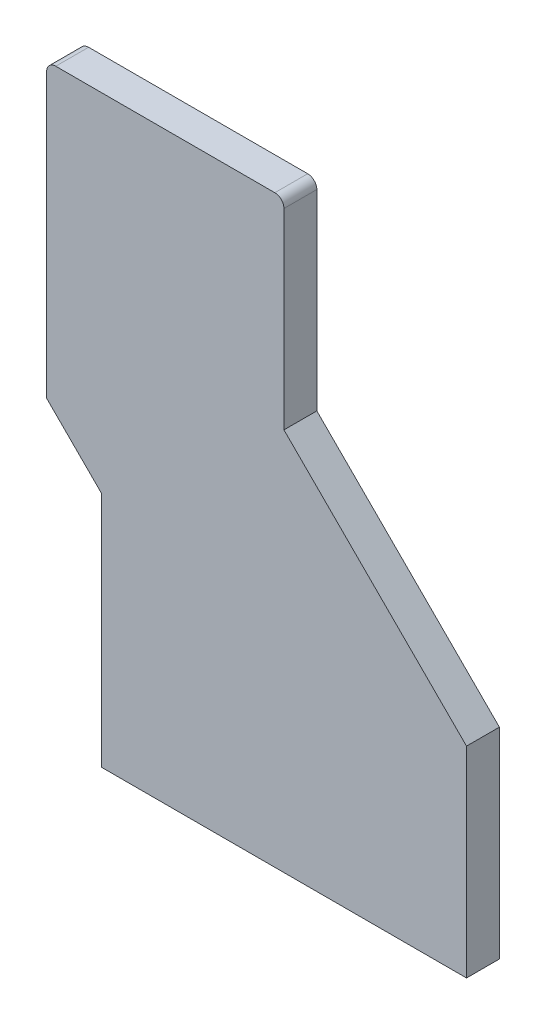
ISO-10303-21;
HEADER;
FILE_DESCRIPTION(('STEP AP214'),'2;1');
FILE_NAME('part.step','',(''),(''),'','','');
FILE_SCHEMA(('AUTOMOTIVE_DESIGN { 1 0 10303 214 1 1 1 1 }'));
ENDSEC;
DATA;
#1=APPLICATION_CONTEXT('core data for automotive mechanical design processes');
#2=APPLICATION_PROTOCOL_DEFINITION('international standard','automotive_design',2000,#1);
#3=PRODUCT_CONTEXT('',#1,'mechanical');
#4=PRODUCT('Part','Part','',(#3));
#5=PRODUCT_RELATED_PRODUCT_CATEGORY('part','',(#4));
#6=PRODUCT_DEFINITION_FORMATION('','',#4);
#7=PRODUCT_DEFINITION_CONTEXT('part definition',#1,'design');
#8=PRODUCT_DEFINITION('design','',#6,#7);
#9=PRODUCT_DEFINITION_SHAPE('','',#8);
#10=(LENGTH_UNIT() NAMED_UNIT(*) SI_UNIT(.MILLI.,.METRE.));
#11=(NAMED_UNIT(*) PLANE_ANGLE_UNIT() SI_UNIT($,.RADIAN.));
#12=(NAMED_UNIT(*) SI_UNIT($,.STERADIAN.) SOLID_ANGLE_UNIT());
#13=UNCERTAINTY_MEASURE_WITH_UNIT(LENGTH_MEASURE(1.E-05),#10,'distance_accuracy_value','');
#14=(GEOMETRIC_REPRESENTATION_CONTEXT(3) GLOBAL_UNCERTAINTY_ASSIGNED_CONTEXT((#13)) GLOBAL_UNIT_ASSIGNED_CONTEXT((#10,
#11,#12)) REPRESENTATION_CONTEXT('',''));
#15=CARTESIAN_POINT('',(0.,0.,0.));
#16=DIRECTION('',(0.,0.,1.));
#17=DIRECTION('',(1.,0.,0.));
#18=AXIS2_PLACEMENT_3D('',#15,#16,#17);
#19=CARTESIAN_POINT('',(104.070181983146,-56.5122911730335,18.));
#20=DIRECTION('',(-1.,0.,0.));
#21=DIRECTION('',(0.,0.,1.));
#22=AXIS2_PLACEMENT_3D('',#19,#20,#21);
#23=PLANE('',#22);
#24=DIRECTION('',(0.,1.,0.));
#25=VECTOR('',#24,1.);
#26=CARTESIAN_POINT('',(104.070181983146,-56.5122911730335,0.));
#27=LINE('',#26,#25);
#28=CARTESIAN_POINT('',(104.070181983146,-166.512291173034,0.));
#29=VERTEX_POINT('',#28);
#30=CARTESIAN_POINT('',(104.070181983146,-56.5122911730335,0.));
#31=VERTEX_POINT('',#30);
#32=EDGE_CURVE('E141',#29,#31,#27,.T.);
#33=ORIENTED_EDGE('',*,*,#32,.T.);
#34=DIRECTION('',(0.,0.,-1.));
#35=VECTOR('',#34,1.);
#36=CARTESIAN_POINT('',(104.070181983146,-56.5122911730335,18.));
#37=LINE('',#36,#35);
#38=CARTESIAN_POINT('',(104.070181983146,-56.5122911730335,18.));
#39=VERTEX_POINT('',#38);
#40=EDGE_CURVE('E11',#39,#31,#37,.T.);
#41=ORIENTED_EDGE('',*,*,#40,.F.);
#42=DIRECTION('',(0.,1.,0.));
#43=VECTOR('',#42,1.);
#44=CARTESIAN_POINT('',(104.070181983146,-56.5122911730335,18.));
#45=LINE('',#44,#43);
#46=CARTESIAN_POINT('',(104.070181983146,-166.512291173034,18.));
#47=VERTEX_POINT('',#46);
#48=EDGE_CURVE('E160',#47,#39,#45,.T.);
#49=ORIENTED_EDGE('',*,*,#48,.F.);
#50=DIRECTION('',(0.,0.,-1.));
#51=VECTOR('',#50,1.);
#52=CARTESIAN_POINT('',(104.070181983146,-166.512291173034,18.));
#53=LINE('',#52,#51);
#54=EDGE_CURVE('E137',#47,#29,#53,.T.);
#55=ORIENTED_EDGE('',*,*,#54,.T.);
#56=EDGE_LOOP('',(#33,#41,#49,#55));
#57=FACE_BOUND('',#56,.T.);
#58=ADVANCED_FACE('F33',(#57),#23,.F.);
#59=CARTESIAN_POINT('',(4.07018198314597,43.4877088269665,18.));
#60=DIRECTION('',(-0.707106781186547,-0.707106781186547,0.));
#61=DIRECTION('',(0.707106781186548,-0.707106781186548,0.));
#62=AXIS2_PLACEMENT_3D('',#59,#60,#61);
#63=PLANE('',#62);
#64=DIRECTION('',(-0.707106781186547,0.707106781186547,0.));
#65=VECTOR('',#64,1.);
#66=CARTESIAN_POINT('',(4.07018198314597,43.4877088269665,0.));
#67=LINE('',#66,#65);
#68=CARTESIAN_POINT('',(4.07018198314597,43.4877088269665,0.));
#69=VERTEX_POINT('',#68);
#70=EDGE_CURVE('E144',#31,#69,#67,.T.);
#71=ORIENTED_EDGE('',*,*,#70,.T.);
#72=DIRECTION('',(0.,0.,-1.));
#73=VECTOR('',#72,1.);
#74=CARTESIAN_POINT('',(4.07018198314597,43.4877088269665,18.));
#75=LINE('',#74,#73);
#76=CARTESIAN_POINT('',(4.07018198314597,43.4877088269665,18.));
#77=VERTEX_POINT('',#76);
#78=EDGE_CURVE('E41',#77,#69,#75,.T.);
#79=ORIENTED_EDGE('',*,*,#78,.F.);
#80=DIRECTION('',(-0.707106781186547,0.707106781186547,0.));
#81=VECTOR('',#80,1.);
#82=CARTESIAN_POINT('',(4.07018198314597,43.4877088269665,18.));
#83=LINE('',#82,#81);
#84=EDGE_CURVE('E98',#39,#77,#83,.T.);
#85=ORIENTED_EDGE('',*,*,#84,.F.);
#86=ORIENTED_EDGE('',*,*,#40,.T.);
#87=EDGE_LOOP('',(#71,#79,#85,#86));
#88=FACE_BOUND('',#87,.T.);
#89=ADVANCED_FACE('F208',(#88),#63,.F.);
#90=CARTESIAN_POINT('',(4.07018198314596,148.487708826966,18.));
#91=DIRECTION('',(-1.,0.,0.));
#92=DIRECTION('',(0.,-1.,0.));
#93=AXIS2_PLACEMENT_3D('',#90,#91,#92);
#94=PLANE('',#93);
#95=DIRECTION('',(0.,1.,0.));
#96=VECTOR('',#95,1.);
#97=CARTESIAN_POINT('',(4.07018198314596,148.487708826966,0.));
#98=LINE('',#97,#96);
#99=CARTESIAN_POINT('',(4.07018198314596,148.487708826966,0.));
#100=VERTEX_POINT('',#99);
#101=EDGE_CURVE('E146',#69,#100,#98,.T.);
#102=ORIENTED_EDGE('',*,*,#101,.T.);
#103=DIRECTION('',(0.,0.,-1.));
#104=VECTOR('',#103,1.);
#105=CARTESIAN_POINT('',(4.07018198314596,148.487708826966,18.));
#106=LINE('',#105,#104);
#107=CARTESIAN_POINT('',(4.07018198314596,148.487708826966,18.));
#108=VERTEX_POINT('',#107);
#109=EDGE_CURVE('E173',#108,#100,#106,.T.);
#110=ORIENTED_EDGE('',*,*,#109,.F.);
#111=DIRECTION('',(0.,1.,0.));
#112=VECTOR('',#111,1.);
#113=CARTESIAN_POINT('',(4.07018198314596,148.487708826966,18.));
#114=LINE('',#113,#112);
#115=EDGE_CURVE('E181',#77,#108,#114,.T.);
#116=ORIENTED_EDGE('',*,*,#115,.F.);
#117=ORIENTED_EDGE('',*,*,#78,.T.);
#118=EDGE_LOOP('',(#102,#110,#116,#117));
#119=FACE_BOUND('',#118,.T.);
#120=ADVANCED_FACE('F179',(#119),#94,.F.);
#121=CARTESIAN_POINT('',(-0.929818016854041,148.487708826966,18.));
#122=DIRECTION('',(0.,0.,-1.));
#123=DIRECTION('',(-1.,0.,0.));
#124=AXIS2_PLACEMENT_3D('',#121,#122,#123);
#125=CYLINDRICAL_SURFACE('',#124,5.);
#126=CARTESIAN_POINT('',(-0.929818016854041,148.487708826966,0.));
#127=DIRECTION('',(0.,0.,1.));
#128=DIRECTION('',(1.,0.,0.));
#129=AXIS2_PLACEMENT_3D('',#126,#127,#128);
#130=CIRCLE('',#129,5.);
#131=CARTESIAN_POINT('',(-0.929818016854076,153.487708826966,0.));
#132=VERTEX_POINT('',#131);
#133=EDGE_CURVE('E148',#100,#132,#130,.T.);
#134=ORIENTED_EDGE('',*,*,#133,.T.);
#135=DIRECTION('',(0.,0.,-1.));
#136=VECTOR('',#135,1.);
#137=CARTESIAN_POINT('',(-0.929818016854076,153.487708826966,18.));
#138=LINE('',#137,#136);
#139=CARTESIAN_POINT('',(-0.929818016854076,153.487708826966,18.));
#140=VERTEX_POINT('',#139);
#141=EDGE_CURVE('E170',#140,#132,#138,.T.);
#142=ORIENTED_EDGE('',*,*,#141,.F.);
#143=CARTESIAN_POINT('',(-0.929818016854041,148.487708826966,18.));
#144=DIRECTION('',(0.,0.,1.));
#145=DIRECTION('',(1.,0.,0.));
#146=AXIS2_PLACEMENT_3D('',#143,#144,#145);
#147=CIRCLE('',#146,5.);
#148=EDGE_CURVE('E198',#108,#140,#147,.T.);
#149=ORIENTED_EDGE('',*,*,#148,.F.);
#150=ORIENTED_EDGE('',*,*,#109,.T.);
#151=EDGE_LOOP('',(#134,#142,#149,#150));
#152=FACE_BOUND('',#151,.T.);
#153=ADVANCED_FACE('F189',(#152),#125,.T.);
#154=CARTESIAN_POINT('',(-95.9298180168541,153.487708826966,18.));
#155=DIRECTION('',(0.,-1.,0.));
#156=DIRECTION('',(0.,0.,-1.));
#157=AXIS2_PLACEMENT_3D('',#154,#155,#156);
#158=PLANE('',#157);
#159=DIRECTION('',(-1.,0.,0.));
#160=VECTOR('',#159,1.);
#161=CARTESIAN_POINT('',(-95.9298180168541,153.487708826966,0.));
#162=LINE('',#161,#160);
#163=CARTESIAN_POINT('',(-120.929818016854,153.487708826966,0.));
#164=VERTEX_POINT('',#163);
#165=EDGE_CURVE('E151',#132,#164,#162,.T.);
#166=ORIENTED_EDGE('',*,*,#165,.T.);
#167=DIRECTION('',(0.,0.,-1.));
#168=VECTOR('',#167,1.);
#169=CARTESIAN_POINT('',(-120.929818016854,153.487708826966,18.));
#170=LINE('',#169,#168);
#171=CARTESIAN_POINT('',(-120.929818016854,153.487708826966,18.));
#172=VERTEX_POINT('',#171);
#173=EDGE_CURVE('E167',#172,#164,#170,.T.);
#174=ORIENTED_EDGE('',*,*,#173,.F.);
#175=DIRECTION('',(-1.,0.,0.));
#176=VECTOR('',#175,1.);
#177=CARTESIAN_POINT('',(-95.9298180168541,153.487708826966,18.));
#178=LINE('',#177,#176);
#179=EDGE_CURVE('E195',#140,#172,#178,.T.);
#180=ORIENTED_EDGE('',*,*,#179,.F.);
#181=ORIENTED_EDGE('',*,*,#141,.T.);
#182=EDGE_LOOP('',(#166,#174,#180,#181));
#183=FACE_BOUND('',#182,.T.);
#184=ADVANCED_FACE('F193',(#183),#158,.F.);
#185=CARTESIAN_POINT('',(-120.929818016854,148.487708826966,18.));
#186=DIRECTION('',(0.,0.,-1.));
#187=DIRECTION('',(-1.,0.,0.));
#188=AXIS2_PLACEMENT_3D('',#185,#186,#187);
#189=CYLINDRICAL_SURFACE('',#188,5.);
#190=CARTESIAN_POINT('',(-120.929818016854,148.487708826966,0.));
#191=DIRECTION('',(0.,0.,1.));
#192=DIRECTION('',(1.,0.,0.));
#193=AXIS2_PLACEMENT_3D('',#190,#191,#192);
#194=CIRCLE('',#193,5.);
#195=CARTESIAN_POINT('',(-125.929818016854,148.487708826966,0.));
#196=VERTEX_POINT('',#195);
#197=EDGE_CURVE('E153',#164,#196,#194,.T.);
#198=ORIENTED_EDGE('',*,*,#197,.T.);
#199=DIRECTION('',(0.,0.,-1.));
#200=VECTOR('',#199,1.);
#201=CARTESIAN_POINT('',(-125.929818016854,148.487708826966,18.));
#202=LINE('',#201,#200);
#203=CARTESIAN_POINT('',(-125.929818016854,148.487708826966,18.));
#204=VERTEX_POINT('',#203);
#205=EDGE_CURVE('E164',#204,#196,#202,.T.);
#206=ORIENTED_EDGE('',*,*,#205,.F.);
#207=CARTESIAN_POINT('',(-120.929818016854,148.487708826966,18.));
#208=DIRECTION('',(0.,0.,1.));
#209=DIRECTION('',(1.,0.,0.));
#210=AXIS2_PLACEMENT_3D('',#207,#208,#209);
#211=CIRCLE('',#210,5.);
#212=EDGE_CURVE('E197',#172,#204,#211,.T.);
#213=ORIENTED_EDGE('',*,*,#212,.F.);
#214=ORIENTED_EDGE('',*,*,#173,.T.);
#215=EDGE_LOOP('',(#198,#206,#213,#214));
#216=FACE_BOUND('',#215,.T.);
#217=ADVANCED_FACE('F220',(#216),#189,.T.);
#218=CARTESIAN_POINT('',(-125.929818016854,148.487708826966,18.));
#219=DIRECTION('',(1.,0.,0.));
#220=DIRECTION('',(0.,0.,-1.));
#221=AXIS2_PLACEMENT_3D('',#218,#219,#220);
#222=PLANE('',#221);
#223=DIRECTION('',(0.,-1.,0.));
#224=VECTOR('',#223,1.);
#225=CARTESIAN_POINT('',(-125.929818016854,148.487708826966,0.));
#226=LINE('',#225,#224);
#227=CARTESIAN_POINT('',(-125.929818016854,-6.51229117303351,0.));
#228=VERTEX_POINT('',#227);
#229=EDGE_CURVE('E155',#196,#228,#226,.T.);
#230=ORIENTED_EDGE('',*,*,#229,.T.);
#231=DIRECTION('',(0.,0.,-1.));
#232=VECTOR('',#231,1.);
#233=CARTESIAN_POINT('',(-125.929818016854,-6.51229117303351,18.));
#234=LINE('',#233,#232);
#235=CARTESIAN_POINT('',(-125.929818016854,-6.51229117303351,18.));
#236=VERTEX_POINT('',#235);
#237=EDGE_CURVE('E132',#236,#228,#234,.T.);
#238=ORIENTED_EDGE('',*,*,#237,.F.);
#239=DIRECTION('',(0.,-1.,0.));
#240=VECTOR('',#239,1.);
#241=CARTESIAN_POINT('',(-125.929818016854,148.487708826966,18.));
#242=LINE('',#241,#240);
#243=EDGE_CURVE('E123',#204,#236,#242,.T.);
#244=ORIENTED_EDGE('',*,*,#243,.F.);
#245=ORIENTED_EDGE('',*,*,#205,.T.);
#246=EDGE_LOOP('',(#230,#238,#244,#245));
#247=FACE_BOUND('',#246,.T.);
#248=ADVANCED_FACE('F223',(#247),#222,.F.);
#249=CARTESIAN_POINT('',(-125.929818016854,-6.51229117303351,18.));
#250=DIRECTION('',(0.707106781186548,0.707106781186547,0.));
#251=DIRECTION('',(-0.707106781186547,0.707106781186548,0.));
#252=AXIS2_PLACEMENT_3D('',#249,#250,#251);
#253=PLANE('',#252);
#254=DIRECTION('',(0.707106781186547,-0.707106781186548,0.));
#255=VECTOR('',#254,1.);
#256=CARTESIAN_POINT('',(-125.929818016854,-6.51229117303351,0.));
#257=LINE('',#256,#255);
#258=CARTESIAN_POINT('',(-95.929818016854,-36.5122911730335,0.));
#259=VERTEX_POINT('',#258);
#260=EDGE_CURVE('E131',#228,#259,#257,.T.);
#261=ORIENTED_EDGE('',*,*,#260,.T.);
#262=DIRECTION('',(0.,0.,-1.));
#263=VECTOR('',#262,1.);
#264=CARTESIAN_POINT('',(-95.929818016854,-36.5122911730335,18.));
#265=LINE('',#264,#263);
#266=CARTESIAN_POINT('',(-95.929818016854,-36.5122911730335,18.));
#267=VERTEX_POINT('',#266);
#268=EDGE_CURVE('E128',#267,#259,#265,.T.);
#269=ORIENTED_EDGE('',*,*,#268,.F.);
#270=DIRECTION('',(0.707106781186547,-0.707106781186548,0.));
#271=VECTOR('',#270,1.);
#272=CARTESIAN_POINT('',(-125.929818016854,-6.51229117303351,18.));
#273=LINE('',#272,#271);
#274=EDGE_CURVE('E117',#236,#267,#273,.T.);
#275=ORIENTED_EDGE('',*,*,#274,.F.);
#276=ORIENTED_EDGE('',*,*,#237,.T.);
#277=EDGE_LOOP('',(#261,#269,#275,#276));
#278=FACE_BOUND('',#277,.T.);
#279=ADVANCED_FACE('F129',(#278),#253,.F.);
#280=CARTESIAN_POINT('',(-95.929818016854,-36.5122911730335,18.));
#281=DIRECTION('',(1.,0.,0.));
#282=DIRECTION('',(0.,0.,-1.));
#283=AXIS2_PLACEMENT_3D('',#280,#281,#282);
#284=PLANE('',#283);
#285=DIRECTION('',(0.,-1.,0.));
#286=VECTOR('',#285,1.);
#287=CARTESIAN_POINT('',(-95.929818016854,-36.5122911730335,0.));
#288=LINE('',#287,#286);
#289=CARTESIAN_POINT('',(-95.929818016854,-166.512291173034,0.));
#290=VERTEX_POINT('',#289);
#291=EDGE_CURVE('E84',#259,#290,#288,.T.);
#292=ORIENTED_EDGE('',*,*,#291,.T.);
#293=DIRECTION('',(0.,0.,-1.));
#294=VECTOR('',#293,1.);
#295=CARTESIAN_POINT('',(-95.929818016854,-166.512291173034,18.));
#296=LINE('',#295,#294);
#297=CARTESIAN_POINT('',(-95.929818016854,-166.512291173034,18.));
#298=VERTEX_POINT('',#297);
#299=EDGE_CURVE('E133',#298,#290,#296,.T.);
#300=ORIENTED_EDGE('',*,*,#299,.F.);
#301=DIRECTION('',(0.,-1.,0.));
#302=VECTOR('',#301,1.);
#303=CARTESIAN_POINT('',(-95.929818016854,-36.5122911730335,18.));
#304=LINE('',#303,#302);
#305=EDGE_CURVE('E121',#267,#298,#304,.T.);
#306=ORIENTED_EDGE('',*,*,#305,.F.);
#307=ORIENTED_EDGE('',*,*,#268,.T.);
#308=EDGE_LOOP('',(#292,#300,#306,#307));
#309=FACE_BOUND('',#308,.T.);
#310=ADVANCED_FACE('F135',(#309),#284,.F.);
#311=CARTESIAN_POINT('',(-95.929818016854,-166.512291173034,18.));
#312=DIRECTION('',(0.,1.,0.));
#313=DIRECTION('',(0.,0.,1.));
#314=AXIS2_PLACEMENT_3D('',#311,#312,#313);
#315=PLANE('',#314);
#316=DIRECTION('',(1.,0.,0.));
#317=VECTOR('',#316,1.);
#318=CARTESIAN_POINT('',(-95.929818016854,-166.512291173034,0.));
#319=LINE('',#318,#317);
#320=EDGE_CURVE('E90',#290,#29,#319,.T.);
#321=ORIENTED_EDGE('',*,*,#320,.T.);
#322=ORIENTED_EDGE('',*,*,#54,.F.);
#323=DIRECTION('',(1.,0.,0.));
#324=VECTOR('',#323,1.);
#325=CARTESIAN_POINT('',(-95.929818016854,-166.512291173034,18.));
#326=LINE('',#325,#324);
#327=EDGE_CURVE('E49',#298,#47,#326,.T.);
#328=ORIENTED_EDGE('',*,*,#327,.F.);
#329=ORIENTED_EDGE('',*,*,#299,.T.);
#330=EDGE_LOOP('',(#321,#322,#328,#329));
#331=FACE_BOUND('',#330,.T.);
#332=ADVANCED_FACE('F232',(#331),#315,.F.);
#333=CARTESIAN_POINT('',(-120.929818016854,148.487708826966,18.));
#334=DIRECTION('',(0.,0.,1.));
#335=DIRECTION('',(1.,0.,0.));
#336=AXIS2_PLACEMENT_3D('',#333,#334,#335);
#337=PLANE('',#336);
#338=ORIENTED_EDGE('',*,*,#48,.T.);
#339=ORIENTED_EDGE('',*,*,#84,.T.);
#340=ORIENTED_EDGE('',*,*,#115,.T.);
#341=ORIENTED_EDGE('',*,*,#148,.T.);
#342=ORIENTED_EDGE('',*,*,#179,.T.);
#343=ORIENTED_EDGE('',*,*,#212,.T.);
#344=ORIENTED_EDGE('',*,*,#243,.T.);
#345=ORIENTED_EDGE('',*,*,#274,.T.);
#346=ORIENTED_EDGE('',*,*,#305,.T.);
#347=ORIENTED_EDGE('',*,*,#327,.T.);
#348=EDGE_LOOP('',(#338,#339,#340,#341,#342,#343,#344,#345,#346,#347));
#349=FACE_BOUND('',#348,.T.);
#350=ADVANCED_FACE('F119',(#349),#337,.T.);
#351=CARTESIAN_POINT('',(-120.929818016854,148.487708826966,0.));
#352=DIRECTION('',(0.,0.,1.));
#353=DIRECTION('',(1.,0.,0.));
#354=AXIS2_PLACEMENT_3D('',#351,#352,#353);
#355=PLANE('',#354);
#356=ORIENTED_EDGE('',*,*,#32,.F.);
#357=ORIENTED_EDGE('',*,*,#320,.F.);
#358=ORIENTED_EDGE('',*,*,#291,.F.);
#359=ORIENTED_EDGE('',*,*,#260,.F.);
#360=ORIENTED_EDGE('',*,*,#229,.F.);
#361=ORIENTED_EDGE('',*,*,#197,.F.);
#362=ORIENTED_EDGE('',*,*,#165,.F.);
#363=ORIENTED_EDGE('',*,*,#133,.F.);
#364=ORIENTED_EDGE('',*,*,#101,.F.);
#365=ORIENTED_EDGE('',*,*,#70,.F.);
#366=EDGE_LOOP('',(#356,#357,#358,#359,#360,#361,#362,#363,#364,#365));
#367=FACE_BOUND('',#366,.T.);
#368=ADVANCED_FACE('F185',(#367),#355,.F.);
#369=CLOSED_SHELL('',(#58,#89,#120,#153,#184,#217,#248,#279,#310,#332,#350,#368));
#370=MANIFOLD_SOLID_BREP('B2',#369);
#371=ADVANCED_BREP_SHAPE_REPRESENTATION('',(#18,#370),#14);
#372=SHAPE_DEFINITION_REPRESENTATION(#9,#371);
ENDSEC;
END-ISO-10303-21;
